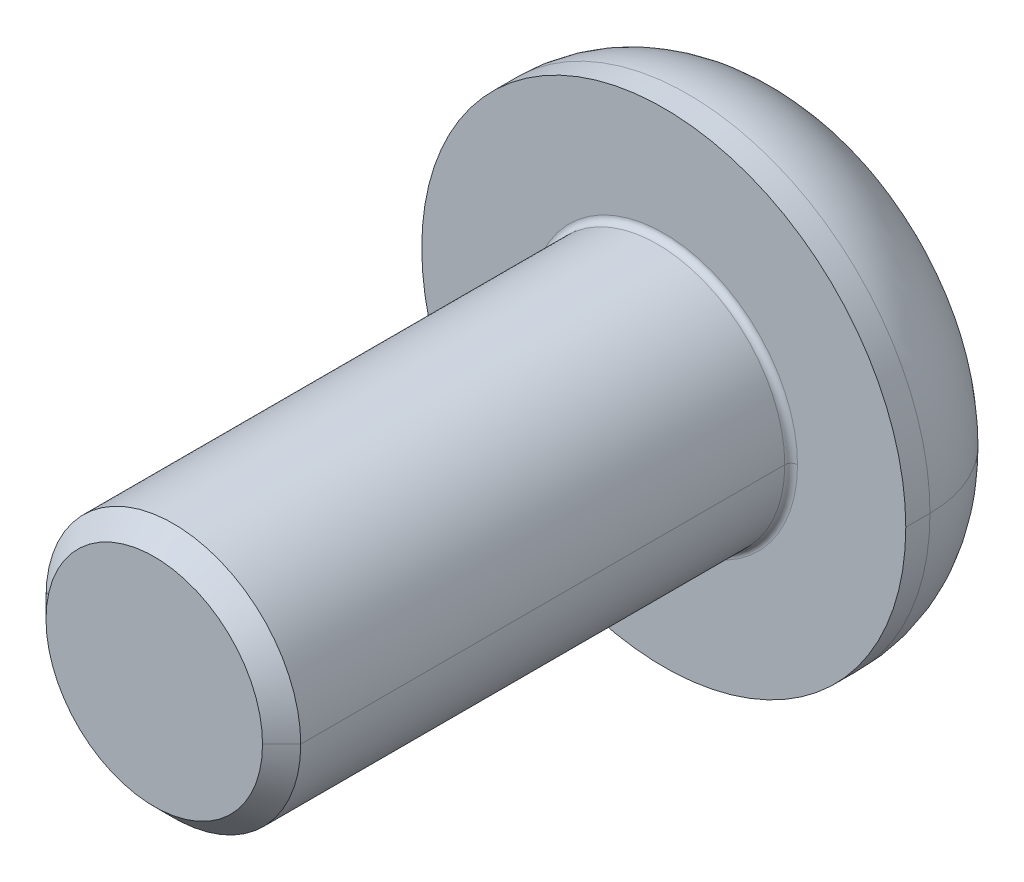
ISO-10303-21;
HEADER;
FILE_DESCRIPTION(('STEP AP214'),'2;1');
FILE_NAME('part.step','',(''),(''),'','','');
FILE_SCHEMA(('AUTOMOTIVE_DESIGN { 1 0 10303 214 1 1 1 1 }'));
ENDSEC;
DATA;
#1=APPLICATION_CONTEXT('core data for automotive mechanical design processes');
#2=APPLICATION_PROTOCOL_DEFINITION('international standard','automotive_design',2000,#1);
#3=PRODUCT_CONTEXT('',#1,'mechanical');
#4=PRODUCT('Part','Part','',(#3));
#5=PRODUCT_RELATED_PRODUCT_CATEGORY('part','',(#4));
#6=PRODUCT_DEFINITION_FORMATION('','',#4);
#7=PRODUCT_DEFINITION_CONTEXT('part definition',#1,'design');
#8=PRODUCT_DEFINITION('design','',#6,#7);
#9=PRODUCT_DEFINITION_SHAPE('','',#8);
#10=(LENGTH_UNIT() NAMED_UNIT(*) SI_UNIT(.MILLI.,.METRE.));
#11=(NAMED_UNIT(*) PLANE_ANGLE_UNIT() SI_UNIT($,.RADIAN.));
#12=(NAMED_UNIT(*) SI_UNIT($,.STERADIAN.) SOLID_ANGLE_UNIT());
#13=UNCERTAINTY_MEASURE_WITH_UNIT(LENGTH_MEASURE(1.E-05),#10,'distance_accuracy_value','');
#14=(GEOMETRIC_REPRESENTATION_CONTEXT(3) GLOBAL_UNCERTAINTY_ASSIGNED_CONTEXT((#13)) GLOBAL_UNIT_ASSIGNED_CONTEXT((#10,
#11,#12)) REPRESENTATION_CONTEXT('',''));
#15=CARTESIAN_POINT('',(0.,0.,0.));
#16=DIRECTION('',(0.,0.,1.));
#17=DIRECTION('',(1.,0.,0.));
#18=AXIS2_PLACEMENT_3D('',#15,#16,#17);
#19=CARTESIAN_POINT('',(0.,0.,0.1));
#20=DIRECTION('',(0.,0.,-1.));
#21=DIRECTION('',(-1.,0.,0.));
#22=AXIS2_PLACEMENT_3D('',#19,#20,#21);
#23=TOROIDAL_SURFACE('',#22,2.1,0.1);
#24=CARTESIAN_POINT('',(2.1,0.,0.1));
#25=DIRECTION('',(0.,1.,0.));
#26=DIRECTION('',(-1.,0.,0.));
#27=AXIS2_PLACEMENT_3D('',#24,#25,#26);
#28=CIRCLE('',#27,0.1);
#29=CARTESIAN_POINT('',(2.1,0.,0.));
#30=VERTEX_POINT('',#29);
#31=CARTESIAN_POINT('',(2.,0.,0.1));
#32=VERTEX_POINT('',#31);
#33=EDGE_CURVE('E296',#30,#32,#28,.T.);
#34=ORIENTED_EDGE('',*,*,#33,.F.);
#35=CARTESIAN_POINT('',(0.,0.,0.));
#36=DIRECTION('',(0.,0.,-1.));
#37=DIRECTION('',(-1.,0.,0.));
#38=AXIS2_PLACEMENT_3D('',#35,#36,#37);
#39=CIRCLE('',#38,2.1);
#40=CARTESIAN_POINT('',(-2.1,0.,0.));
#41=VERTEX_POINT('',#40);
#42=EDGE_CURVE('E187',#41,#30,#39,.T.);
#43=ORIENTED_EDGE('',*,*,#42,.F.);
#44=CARTESIAN_POINT('',(-2.1,0.,0.1));
#45=DIRECTION('',(0.,-1.,0.));
#46=DIRECTION('',(0.,0.,-1.));
#47=AXIS2_PLACEMENT_3D('',#44,#45,#46);
#48=CIRCLE('',#47,0.1);
#49=CARTESIAN_POINT('',(-2.,0.,0.1));
#50=VERTEX_POINT('',#49);
#51=EDGE_CURVE('E303',#41,#50,#48,.T.);
#52=ORIENTED_EDGE('',*,*,#51,.T.);
#53=CARTESIAN_POINT('',(0.,0.,0.1));
#54=DIRECTION('',(0.,0.,1.));
#55=DIRECTION('',(-1.,0.,0.));
#56=AXIS2_PLACEMENT_3D('',#53,#54,#55);
#57=CIRCLE('',#56,2.);
#58=EDGE_CURVE('E163',#32,#50,#57,.T.);
#59=ORIENTED_EDGE('',*,*,#58,.F.);
#60=EDGE_LOOP('',(#34,#43,#52,#59));
#61=FACE_BOUND('',#60,.T.);
#62=ADVANCED_FACE('F17',(#61),#23,.F.);
#63=CARTESIAN_POINT('',(0.,0.,-0.38));
#64=DIRECTION('',(0.,0.,-1.));
#65=DIRECTION('',(-1.,0.,0.));
#66=AXIS2_PLACEMENT_3D('',#63,#64,#65);
#67=TOROIDAL_SURFACE('',#66,1.98,1.82);
#68=CARTESIAN_POINT('',(1.98,0.,-0.38));
#69=DIRECTION('',(0.,1.,0.));
#70=DIRECTION('',(-1.,0.,0.));
#71=AXIS2_PLACEMENT_3D('',#68,#69,#70);
#72=CIRCLE('',#71,1.82);
#73=CARTESIAN_POINT('',(3.8,0.,-0.38));
#74=VERTEX_POINT('',#73);
#75=CARTESIAN_POINT('',(1.98,0.,-2.2));
#76=VERTEX_POINT('',#75);
#77=EDGE_CURVE('E291',#74,#76,#72,.T.);
#78=ORIENTED_EDGE('',*,*,#77,.F.);
#79=CARTESIAN_POINT('',(0.,0.,-0.38));
#80=DIRECTION('',(0.,0.,1.));
#81=DIRECTION('',(-1.,0.,0.));
#82=AXIS2_PLACEMENT_3D('',#79,#80,#81);
#83=CIRCLE('',#82,3.8);
#84=CARTESIAN_POINT('',(-3.8,0.,-0.38));
#85=VERTEX_POINT('',#84);
#86=EDGE_CURVE('E197',#85,#74,#83,.T.);
#87=ORIENTED_EDGE('',*,*,#86,.F.);
#88=CARTESIAN_POINT('',(-1.98,0.,-0.38));
#89=DIRECTION('',(0.,-1.,0.));
#90=DIRECTION('',(0.,0.,-1.));
#91=AXIS2_PLACEMENT_3D('',#88,#89,#90);
#92=CIRCLE('',#91,1.82);
#93=CARTESIAN_POINT('',(-1.98,0.,-2.2));
#94=VERTEX_POINT('',#93);
#95=EDGE_CURVE('E290',#85,#94,#92,.T.);
#96=ORIENTED_EDGE('',*,*,#95,.T.);
#97=CARTESIAN_POINT('',(0.,0.,-2.2));
#98=DIRECTION('',(0.,0.,-1.));
#99=DIRECTION('',(-1.,0.,0.));
#100=AXIS2_PLACEMENT_3D('',#97,#98,#99);
#101=CIRCLE('',#100,1.98);
#102=EDGE_CURVE('E203',#76,#94,#101,.T.);
#103=ORIENTED_EDGE('',*,*,#102,.F.);
#104=EDGE_LOOP('',(#78,#87,#96,#103));
#105=FACE_BOUND('',#104,.T.);
#106=ADVANCED_FACE('F348',(#105),#67,.T.);
#107=CARTESIAN_POINT('',(0.,0.,-0.9));
#108=DIRECTION('',(0.,0.,-1.));
#109=DIRECTION('',(0.,-1.,0.));
#110=AXIS2_PLACEMENT_3D('',#107,#108,#109);
#111=PLANE('',#110);
#112=DIRECTION('',(-1.,0.,0.));
#113=VECTOR('',#112,1.);
#114=CARTESIAN_POINT('',(0.721687836487032,-1.25,-0.9));
#115=LINE('',#114,#113);
#116=CARTESIAN_POINT('',(0.721687836487032,-1.25,-0.9));
#117=VERTEX_POINT('',#116);
#118=CARTESIAN_POINT('',(-0.721687836487032,-1.25,-0.9));
#119=VERTEX_POINT('',#118);
#120=EDGE_CURVE('E193',#117,#119,#115,.T.);
#121=ORIENTED_EDGE('',*,*,#120,.T.);
#122=DIRECTION('',(-0.5,0.866025403784439,0.));
#123=VECTOR('',#122,1.);
#124=CARTESIAN_POINT('',(-0.721687836487032,-1.25,-0.9));
#125=LINE('',#124,#123);
#126=CARTESIAN_POINT('',(-1.44337567297406,0.,-0.9));
#127=VERTEX_POINT('',#126);
#128=EDGE_CURVE('E11',#119,#127,#125,.T.);
#129=ORIENTED_EDGE('',*,*,#128,.T.);
#130=DIRECTION('',(0.5,0.866025403784439,0.));
#131=VECTOR('',#130,1.);
#132=CARTESIAN_POINT('',(-1.44337567297406,0.,-0.9));
#133=LINE('',#132,#131);
#134=CARTESIAN_POINT('',(-0.721687836487033,1.25,-0.9));
#135=VERTEX_POINT('',#134);
#136=EDGE_CURVE('E44',#127,#135,#133,.T.);
#137=ORIENTED_EDGE('',*,*,#136,.T.);
#138=DIRECTION('',(1.,0.,0.));
#139=VECTOR('',#138,1.);
#140=CARTESIAN_POINT('',(-0.721687836487033,1.25,-0.9));
#141=LINE('',#140,#139);
#142=CARTESIAN_POINT('',(0.721687836487032,1.25,-0.9));
#143=VERTEX_POINT('',#142);
#144=EDGE_CURVE('E239',#135,#143,#141,.T.);
#145=ORIENTED_EDGE('',*,*,#144,.T.);
#146=DIRECTION('',(0.5,-0.866025403784439,0.));
#147=VECTOR('',#146,1.);
#148=CARTESIAN_POINT('',(0.721687836487032,1.25,-0.9));
#149=LINE('',#148,#147);
#150=CARTESIAN_POINT('',(1.44337567297406,0.,-0.9));
#151=VERTEX_POINT('',#150);
#152=EDGE_CURVE('E233',#143,#151,#149,.T.);
#153=ORIENTED_EDGE('',*,*,#152,.T.);
#154=DIRECTION('',(-0.5,-0.866025403784439,0.));
#155=VECTOR('',#154,1.);
#156=CARTESIAN_POINT('',(1.44337567297406,0.,-0.9));
#157=LINE('',#156,#155);
#158=EDGE_CURVE('E192',#151,#117,#157,.T.);
#159=ORIENTED_EDGE('',*,*,#158,.T.);
#160=EDGE_LOOP('',(#121,#129,#137,#145,#153,#159));
#161=FACE_BOUND('',#160,.T.);
#162=ADVANCED_FACE('F269',(#161),#111,.T.);
#163=CARTESIAN_POINT('',(-0.721687836487032,-1.25,-0.9));
#164=DIRECTION('',(-0.866025403784439,-0.5,0.));
#165=DIRECTION('',(-0.5,0.866025403784439,0.));
#166=AXIS2_PLACEMENT_3D('',#163,#164,#165);
#167=PLANE('',#166);
#168=DIRECTION('',(-0.5,0.866025403784439,0.));
#169=VECTOR('',#168,1.);
#170=CARTESIAN_POINT('',(-0.721687836487032,-1.25,-2.2));
#171=LINE('',#170,#169);
#172=CARTESIAN_POINT('',(-0.721687836487032,-1.25,-2.2));
#173=VERTEX_POINT('',#172);
#174=CARTESIAN_POINT('',(-1.44337567297406,0.,-2.2));
#175=VERTEX_POINT('',#174);
#176=EDGE_CURVE('E223',#173,#175,#171,.T.);
#177=ORIENTED_EDGE('',*,*,#176,.T.);
#178=DIRECTION('',(0.,0.,-1.));
#179=VECTOR('',#178,1.);
#180=CARTESIAN_POINT('',(-1.44337567297406,0.,-0.9));
#181=LINE('',#180,#179);
#182=EDGE_CURVE('E25',#127,#175,#181,.T.);
#183=ORIENTED_EDGE('',*,*,#182,.F.);
#184=ORIENTED_EDGE('',*,*,#128,.F.);
#185=DIRECTION('',(0.,0.,-1.));
#186=VECTOR('',#185,1.);
#187=CARTESIAN_POINT('',(-0.721687836487032,-1.25,-0.9));
#188=LINE('',#187,#186);
#189=EDGE_CURVE('E229',#119,#173,#188,.T.);
#190=ORIENTED_EDGE('',*,*,#189,.T.);
#191=EDGE_LOOP('',(#177,#183,#184,#190));
#192=FACE_BOUND('',#191,.T.);
#193=ADVANCED_FACE('F255',(#192),#167,.F.);
#194=CARTESIAN_POINT('',(-1.44337567297406,0.,-0.9));
#195=DIRECTION('',(-0.866025403784439,0.5,0.));
#196=DIRECTION('',(0.,0.,1.));
#197=AXIS2_PLACEMENT_3D('',#194,#195,#196);
#198=PLANE('',#197);
#199=DIRECTION('',(0.5,0.866025403784439,0.));
#200=VECTOR('',#199,1.);
#201=CARTESIAN_POINT('',(-1.44337567297406,0.,-2.2));
#202=LINE('',#201,#200);
#203=CARTESIAN_POINT('',(-0.721687836487033,1.25,-2.2));
#204=VERTEX_POINT('',#203);
#205=EDGE_CURVE('E219',#175,#204,#202,.T.);
#206=ORIENTED_EDGE('',*,*,#205,.T.);
#207=DIRECTION('',(0.,0.,-1.));
#208=VECTOR('',#207,1.);
#209=CARTESIAN_POINT('',(-0.721687836487033,1.25,-0.9));
#210=LINE('',#209,#208);
#211=EDGE_CURVE('E242',#135,#204,#210,.T.);
#212=ORIENTED_EDGE('',*,*,#211,.F.);
#213=ORIENTED_EDGE('',*,*,#136,.F.);
#214=ORIENTED_EDGE('',*,*,#182,.T.);
#215=EDGE_LOOP('',(#206,#212,#213,#214));
#216=FACE_BOUND('',#215,.T.);
#217=ADVANCED_FACE('F250',(#216),#198,.F.);
#218=CARTESIAN_POINT('',(-0.721687836487033,1.25,-0.9));
#219=DIRECTION('',(0.,1.,0.));
#220=DIRECTION('',(1.,0.,0.));
#221=AXIS2_PLACEMENT_3D('',#218,#219,#220);
#222=PLANE('',#221);
#223=DIRECTION('',(1.,0.,0.));
#224=VECTOR('',#223,1.);
#225=CARTESIAN_POINT('',(-0.721687836487033,1.25,-2.2));
#226=LINE('',#225,#224);
#227=CARTESIAN_POINT('',(0.721687836487032,1.25,-2.2));
#228=VERTEX_POINT('',#227);
#229=EDGE_CURVE('E215',#204,#228,#226,.T.);
#230=ORIENTED_EDGE('',*,*,#229,.T.);
#231=DIRECTION('',(0.,0.,-1.));
#232=VECTOR('',#231,1.);
#233=CARTESIAN_POINT('',(0.721687836487032,1.25,-0.9));
#234=LINE('',#233,#232);
#235=EDGE_CURVE('E236',#143,#228,#234,.T.);
#236=ORIENTED_EDGE('',*,*,#235,.F.);
#237=ORIENTED_EDGE('',*,*,#144,.F.);
#238=ORIENTED_EDGE('',*,*,#211,.T.);
#239=EDGE_LOOP('',(#230,#236,#237,#238));
#240=FACE_BOUND('',#239,.T.);
#241=ADVANCED_FACE('F266',(#240),#222,.F.);
#242=CARTESIAN_POINT('',(0.721687836487032,1.25,-0.9));
#243=DIRECTION('',(0.866025403784439,0.5,0.));
#244=DIRECTION('',(0.,0.,-1.));
#245=AXIS2_PLACEMENT_3D('',#242,#243,#244);
#246=PLANE('',#245);
#247=DIRECTION('',(0.5,-0.866025403784439,0.));
#248=VECTOR('',#247,1.);
#249=CARTESIAN_POINT('',(0.721687836487032,1.25,-2.2));
#250=LINE('',#249,#248);
#251=CARTESIAN_POINT('',(1.44337567297406,0.,-2.2));
#252=VERTEX_POINT('',#251);
#253=EDGE_CURVE('E214',#228,#252,#250,.T.);
#254=ORIENTED_EDGE('',*,*,#253,.T.);
#255=DIRECTION('',(0.,0.,-1.));
#256=VECTOR('',#255,1.);
#257=CARTESIAN_POINT('',(1.44337567297406,0.,-0.9));
#258=LINE('',#257,#256);
#259=EDGE_CURVE('E230',#151,#252,#258,.T.);
#260=ORIENTED_EDGE('',*,*,#259,.F.);
#261=ORIENTED_EDGE('',*,*,#152,.F.);
#262=ORIENTED_EDGE('',*,*,#235,.T.);
#263=EDGE_LOOP('',(#254,#260,#261,#262));
#264=FACE_BOUND('',#263,.T.);
#265=ADVANCED_FACE('F274',(#264),#246,.F.);
#266=CARTESIAN_POINT('',(1.44337567297406,0.,-0.9));
#267=DIRECTION('',(0.866025403784439,-0.5,0.));
#268=DIRECTION('',(0.,0.,-1.));
#269=AXIS2_PLACEMENT_3D('',#266,#267,#268);
#270=PLANE('',#269);
#271=DIRECTION('',(-0.5,-0.866025403784439,0.));
#272=VECTOR('',#271,1.);
#273=CARTESIAN_POINT('',(1.44337567297406,0.,-2.2));
#274=LINE('',#273,#272);
#275=CARTESIAN_POINT('',(0.721687836487032,-1.25,-2.2));
#276=VERTEX_POINT('',#275);
#277=EDGE_CURVE('E210',#252,#276,#274,.T.);
#278=ORIENTED_EDGE('',*,*,#277,.T.);
#279=DIRECTION('',(0.,0.,-1.));
#280=VECTOR('',#279,1.);
#281=CARTESIAN_POINT('',(0.721687836487032,-1.25,-0.9));
#282=LINE('',#281,#280);
#283=EDGE_CURVE('E190',#117,#276,#282,.T.);
#284=ORIENTED_EDGE('',*,*,#283,.F.);
#285=ORIENTED_EDGE('',*,*,#158,.F.);
#286=ORIENTED_EDGE('',*,*,#259,.T.);
#287=EDGE_LOOP('',(#278,#284,#285,#286));
#288=FACE_BOUND('',#287,.T.);
#289=ADVANCED_FACE('F276',(#288),#270,.F.);
#290=CARTESIAN_POINT('',(0.721687836487032,-1.25,-0.9));
#291=DIRECTION('',(0.,-1.,0.));
#292=DIRECTION('',(-1.,0.,0.));
#293=AXIS2_PLACEMENT_3D('',#290,#291,#292);
#294=PLANE('',#293);
#295=DIRECTION('',(-1.,0.,0.));
#296=VECTOR('',#295,1.);
#297=CARTESIAN_POINT('',(0.721687836487032,-1.25,-2.2));
#298=LINE('',#297,#296);
#299=EDGE_CURVE('E206',#276,#173,#298,.T.);
#300=ORIENTED_EDGE('',*,*,#299,.T.);
#301=ORIENTED_EDGE('',*,*,#189,.F.);
#302=ORIENTED_EDGE('',*,*,#120,.F.);
#303=ORIENTED_EDGE('',*,*,#283,.T.);
#304=EDGE_LOOP('',(#300,#301,#302,#303));
#305=FACE_BOUND('',#304,.T.);
#306=ADVANCED_FACE('F358',(#305),#294,.F.);
#307=CARTESIAN_POINT('',(0.,0.,0.));
#308=DIRECTION('',(0.,0.,-1.));
#309=DIRECTION('',(0.,-1.,0.));
#310=AXIS2_PLACEMENT_3D('',#307,#308,#309);
#311=PLANE('',#310);
#312=ORIENTED_EDGE('',*,*,#42,.T.);
#313=CARTESIAN_POINT('',(0.,0.,0.));
#314=DIRECTION('',(0.,0.,-1.));
#315=DIRECTION('',(-1.,0.,0.));
#316=AXIS2_PLACEMENT_3D('',#313,#314,#315);
#317=CIRCLE('',#316,2.1);
#318=EDGE_CURVE('E292',#30,#41,#317,.T.);
#319=ORIENTED_EDGE('',*,*,#318,.T.);
#320=EDGE_LOOP('',(#312,#319));
#321=FACE_BOUND('',#320,.T.);
#322=CARTESIAN_POINT('',(0.,0.,0.));
#323=DIRECTION('',(0.,0.,-1.));
#324=DIRECTION('',(-1.,0.,0.));
#325=AXIS2_PLACEMENT_3D('',#322,#323,#324);
#326=CIRCLE('',#325,3.8);
#327=CARTESIAN_POINT('',(3.8,0.,0.));
#328=VERTEX_POINT('',#327);
#329=CARTESIAN_POINT('',(-3.8,0.,0.));
#330=VERTEX_POINT('',#329);
#331=EDGE_CURVE('E200',#328,#330,#326,.T.);
#332=ORIENTED_EDGE('',*,*,#331,.F.);
#333=CARTESIAN_POINT('',(0.,0.,0.));
#334=DIRECTION('',(0.,0.,-1.));
#335=DIRECTION('',(-1.,0.,0.));
#336=AXIS2_PLACEMENT_3D('',#333,#334,#335);
#337=CIRCLE('',#336,3.8);
#338=EDGE_CURVE('E309',#330,#328,#337,.T.);
#339=ORIENTED_EDGE('',*,*,#338,.F.);
#340=EDGE_LOOP('',(#332,#339));
#341=FACE_BOUND('',#340,.T.);
#342=ADVANCED_FACE('F350',(#321,#341),#311,.F.);
#343=CARTESIAN_POINT('',(0.,0.,-2.2));
#344=DIRECTION('',(0.,0.,-1.));
#345=DIRECTION('',(0.,-1.,0.));
#346=AXIS2_PLACEMENT_3D('',#343,#344,#345);
#347=PLANE('',#346);
#348=ORIENTED_EDGE('',*,*,#299,.F.);
#349=ORIENTED_EDGE('',*,*,#277,.F.);
#350=ORIENTED_EDGE('',*,*,#253,.F.);
#351=ORIENTED_EDGE('',*,*,#229,.F.);
#352=ORIENTED_EDGE('',*,*,#205,.F.);
#353=ORIENTED_EDGE('',*,*,#176,.F.);
#354=EDGE_LOOP('',(#348,#349,#350,#351,#352,#353));
#355=FACE_BOUND('',#354,.T.);
#356=CARTESIAN_POINT('',(0.,0.,-2.2));
#357=DIRECTION('',(0.,0.,-1.));
#358=DIRECTION('',(-1.,0.,0.));
#359=AXIS2_PLACEMENT_3D('',#356,#357,#358);
#360=CIRCLE('',#359,1.98);
#361=EDGE_CURVE('E286',#94,#76,#360,.T.);
#362=ORIENTED_EDGE('',*,*,#361,.T.);
#363=ORIENTED_EDGE('',*,*,#102,.T.);
#364=EDGE_LOOP('',(#362,#363));
#365=FACE_BOUND('',#364,.T.);
#366=ADVANCED_FACE('F259',(#355,#365),#347,.T.);
#367=CARTESIAN_POINT('',(0.,0.,-2.2));
#368=DIRECTION('',(0.,0.,1.));
#369=DIRECTION('',(1.,0.,0.));
#370=AXIS2_PLACEMENT_3D('',#367,#368,#369);
#371=CYLINDRICAL_SURFACE('',#370,3.8);
#372=DIRECTION('',(0.,0.,1.));
#373=VECTOR('',#372,1.);
#374=CARTESIAN_POINT('',(-3.8,0.,-2.2));
#375=LINE('',#374,#373);
#376=EDGE_CURVE('E315',#85,#330,#375,.T.);
#377=ORIENTED_EDGE('',*,*,#376,.F.);
#378=ORIENTED_EDGE('',*,*,#86,.T.);
#379=DIRECTION('',(0.,0.,1.));
#380=VECTOR('',#379,1.);
#381=CARTESIAN_POINT('',(3.8,0.,-2.2));
#382=LINE('',#381,#380);
#383=EDGE_CURVE('E285',#74,#328,#382,.T.);
#384=ORIENTED_EDGE('',*,*,#383,.T.);
#385=ORIENTED_EDGE('',*,*,#331,.T.);
#386=EDGE_LOOP('',(#377,#378,#384,#385));
#387=FACE_BOUND('',#386,.T.);
#388=ADVANCED_FACE('F342',(#387),#371,.T.);
#389=CARTESIAN_POINT('',(0.,0.,8.));
#390=DIRECTION('',(0.,0.,-1.));
#391=DIRECTION('',(-1.,0.,0.));
#392=AXIS2_PLACEMENT_3D('',#389,#390,#391);
#393=CONICAL_SURFACE('',#392,1.7,0.785398163397451);
#394=DIRECTION('',(0.70710678118655,0.,-0.707106781186546));
#395=VECTOR('',#394,1.);
#396=CARTESIAN_POINT('',(1.7,0.,8.));
#397=LINE('',#396,#395);
#398=CARTESIAN_POINT('',(1.7,0.,8.));
#399=VERTEX_POINT('',#398);
#400=CARTESIAN_POINT('',(2.,0.,7.7));
#401=VERTEX_POINT('',#400);
#402=EDGE_CURVE('E176',#399,#401,#397,.T.);
#403=ORIENTED_EDGE('',*,*,#402,.F.);
#404=CARTESIAN_POINT('',(0.,0.,8.));
#405=DIRECTION('',(0.,0.,1.));
#406=DIRECTION('',(1.,0.,0.));
#407=AXIS2_PLACEMENT_3D('',#404,#405,#406);
#408=CIRCLE('',#407,1.7);
#409=CARTESIAN_POINT('',(-1.7,0.,8.));
#410=VERTEX_POINT('',#409);
#411=EDGE_CURVE('E156',#410,#399,#408,.T.);
#412=ORIENTED_EDGE('',*,*,#411,.F.);
#413=DIRECTION('',(-0.70710678118655,0.,-0.707106781186546));
#414=VECTOR('',#413,1.);
#415=CARTESIAN_POINT('',(-1.7,0.,8.));
#416=LINE('',#415,#414);
#417=CARTESIAN_POINT('',(-2.,0.,7.7));
#418=VERTEX_POINT('',#417);
#419=EDGE_CURVE('E168',#410,#418,#416,.T.);
#420=ORIENTED_EDGE('',*,*,#419,.T.);
#421=CARTESIAN_POINT('',(0.,0.,7.7));
#422=DIRECTION('',(0.,0.,-1.));
#423=DIRECTION('',(1.,0.,0.));
#424=AXIS2_PLACEMENT_3D('',#421,#422,#423);
#425=CIRCLE('',#424,2.);
#426=EDGE_CURVE('E143',#401,#418,#425,.T.);
#427=ORIENTED_EDGE('',*,*,#426,.F.);
#428=EDGE_LOOP('',(#403,#412,#420,#427));
#429=FACE_BOUND('',#428,.T.);
#430=ADVANCED_FACE('F169',(#429),#393,.T.);
#431=CARTESIAN_POINT('',(0.,0.,8.));
#432=DIRECTION('',(0.,0.,1.));
#433=DIRECTION('',(1.,0.,0.));
#434=AXIS2_PLACEMENT_3D('',#431,#432,#433);
#435=PLANE('',#434);
#436=ORIENTED_EDGE('',*,*,#411,.T.);
#437=CARTESIAN_POINT('',(0.,0.,8.));
#438=DIRECTION('',(0.,0.,1.));
#439=DIRECTION('',(1.,0.,0.));
#440=AXIS2_PLACEMENT_3D('',#437,#438,#439);
#441=CIRCLE('',#440,1.7);
#442=EDGE_CURVE('E183',#399,#410,#441,.T.);
#443=ORIENTED_EDGE('',*,*,#442,.T.);
#444=EDGE_LOOP('',(#436,#443));
#445=FACE_BOUND('',#444,.T.);
#446=ADVANCED_FACE('F603',(#445),#435,.T.);
#447=CARTESIAN_POINT('',(0.,0.,8.));
#448=DIRECTION('',(0.,0.,-1.));
#449=DIRECTION('',(-1.,0.,0.));
#450=AXIS2_PLACEMENT_3D('',#447,#448,#449);
#451=CYLINDRICAL_SURFACE('',#450,2.);
#452=DIRECTION('',(0.,0.,-1.));
#453=VECTOR('',#452,1.);
#454=CARTESIAN_POINT('',(2.,0.,8.));
#455=LINE('',#454,#453);
#456=EDGE_CURVE('E150',#401,#32,#455,.T.);
#457=ORIENTED_EDGE('',*,*,#456,.F.);
#458=ORIENTED_EDGE('',*,*,#426,.T.);
#459=DIRECTION('',(0.,0.,-1.));
#460=VECTOR('',#459,1.);
#461=CARTESIAN_POINT('',(-2.,0.,8.));
#462=LINE('',#461,#460);
#463=EDGE_CURVE('E147',#418,#50,#462,.T.);
#464=ORIENTED_EDGE('',*,*,#463,.T.);
#465=CARTESIAN_POINT('',(0.,0.,0.1));
#466=DIRECTION('',(0.,0.,1.));
#467=DIRECTION('',(-1.,0.,0.));
#468=AXIS2_PLACEMENT_3D('',#465,#466,#467);
#469=CIRCLE('',#468,2.);
#470=EDGE_CURVE('E299',#50,#32,#469,.T.);
#471=ORIENTED_EDGE('',*,*,#470,.T.);
#472=EDGE_LOOP('',(#457,#458,#464,#471));
#473=FACE_BOUND('',#472,.T.);
#474=ADVANCED_FACE('F145',(#473),#451,.T.);
#475=CARTESIAN_POINT('',(0.,0.,8.));
#476=DIRECTION('',(0.,0.,-1.));
#477=DIRECTION('',(-1.,0.,0.));
#478=AXIS2_PLACEMENT_3D('',#475,#476,#477);
#479=CYLINDRICAL_SURFACE('',#478,2.);
#480=CARTESIAN_POINT('',(0.,0.,7.7));
#481=DIRECTION('',(0.,0.,-1.));
#482=DIRECTION('',(1.,0.,0.));
#483=AXIS2_PLACEMENT_3D('',#480,#481,#482);
#484=CIRCLE('',#483,2.);
#485=EDGE_CURVE('E161',#418,#401,#484,.T.);
#486=ORIENTED_EDGE('',*,*,#485,.T.);
#487=ORIENTED_EDGE('',*,*,#456,.T.);
#488=ORIENTED_EDGE('',*,*,#58,.T.);
#489=ORIENTED_EDGE('',*,*,#463,.F.);
#490=EDGE_LOOP('',(#486,#487,#488,#489));
#491=FACE_BOUND('',#490,.T.);
#492=ADVANCED_FACE('F159',(#491),#479,.T.);
#493=CARTESIAN_POINT('',(0.,0.,8.));
#494=DIRECTION('',(0.,0.,-1.));
#495=DIRECTION('',(-1.,0.,0.));
#496=AXIS2_PLACEMENT_3D('',#493,#494,#495);
#497=CONICAL_SURFACE('',#496,1.7,0.785398163397451);
#498=ORIENTED_EDGE('',*,*,#442,.F.);
#499=ORIENTED_EDGE('',*,*,#402,.T.);
#500=ORIENTED_EDGE('',*,*,#485,.F.);
#501=ORIENTED_EDGE('',*,*,#419,.F.);
#502=EDGE_LOOP('',(#498,#499,#500,#501));
#503=FACE_BOUND('',#502,.T.);
#504=ADVANCED_FACE('F175',(#503),#497,.T.);
#505=CARTESIAN_POINT('',(0.,0.,-2.2));
#506=DIRECTION('',(0.,0.,1.));
#507=DIRECTION('',(1.,0.,0.));
#508=AXIS2_PLACEMENT_3D('',#505,#506,#507);
#509=CYLINDRICAL_SURFACE('',#508,3.8);
#510=CARTESIAN_POINT('',(0.,0.,-0.38));
#511=DIRECTION('',(0.,0.,1.));
#512=DIRECTION('',(-1.,0.,0.));
#513=AXIS2_PLACEMENT_3D('',#510,#511,#512);
#514=CIRCLE('',#513,3.8);
#515=EDGE_CURVE('E318',#74,#85,#514,.T.);
#516=ORIENTED_EDGE('',*,*,#515,.T.);
#517=ORIENTED_EDGE('',*,*,#376,.T.);
#518=ORIENTED_EDGE('',*,*,#338,.T.);
#519=ORIENTED_EDGE('',*,*,#383,.F.);
#520=EDGE_LOOP('',(#516,#517,#518,#519));
#521=FACE_BOUND('',#520,.T.);
#522=ADVANCED_FACE('F336',(#521),#509,.T.);
#523=CARTESIAN_POINT('',(0.,0.,-0.38));
#524=DIRECTION('',(0.,0.,-1.));
#525=DIRECTION('',(-1.,0.,0.));
#526=AXIS2_PLACEMENT_3D('',#523,#524,#525);
#527=TOROIDAL_SURFACE('',#526,1.98,1.82);
#528=ORIENTED_EDGE('',*,*,#515,.F.);
#529=ORIENTED_EDGE('',*,*,#77,.T.);
#530=ORIENTED_EDGE('',*,*,#361,.F.);
#531=ORIENTED_EDGE('',*,*,#95,.F.);
#532=EDGE_LOOP('',(#528,#529,#530,#531));
#533=FACE_BOUND('',#532,.T.);
#534=ADVANCED_FACE('F345',(#533),#527,.T.);
#535=CARTESIAN_POINT('',(0.,0.,0.1));
#536=DIRECTION('',(0.,0.,-1.));
#537=DIRECTION('',(-1.,0.,0.));
#538=AXIS2_PLACEMENT_3D('',#535,#536,#537);
#539=TOROIDAL_SURFACE('',#538,2.1,0.1);
#540=ORIENTED_EDGE('',*,*,#318,.F.);
#541=ORIENTED_EDGE('',*,*,#33,.T.);
#542=ORIENTED_EDGE('',*,*,#470,.F.);
#543=ORIENTED_EDGE('',*,*,#51,.F.);
#544=EDGE_LOOP('',(#540,#541,#542,#543));
#545=FACE_BOUND('',#544,.T.);
#546=ADVANCED_FACE('F373',(#545),#539,.F.);
#547=CLOSED_SHELL('',(#62,#106,#162,#193,#217,#241,#265,#289,#306,#342,#366,#388,#430,#446,#474,
#492,#504,#522,#534,#546));
#548=MANIFOLD_SOLID_BREP('B1',#547);
#549=ADVANCED_BREP_SHAPE_REPRESENTATION('',(#18,#548),#14);
#550=SHAPE_DEFINITION_REPRESENTATION(#9,#549);
ENDSEC;
END-ISO-10303-21;
